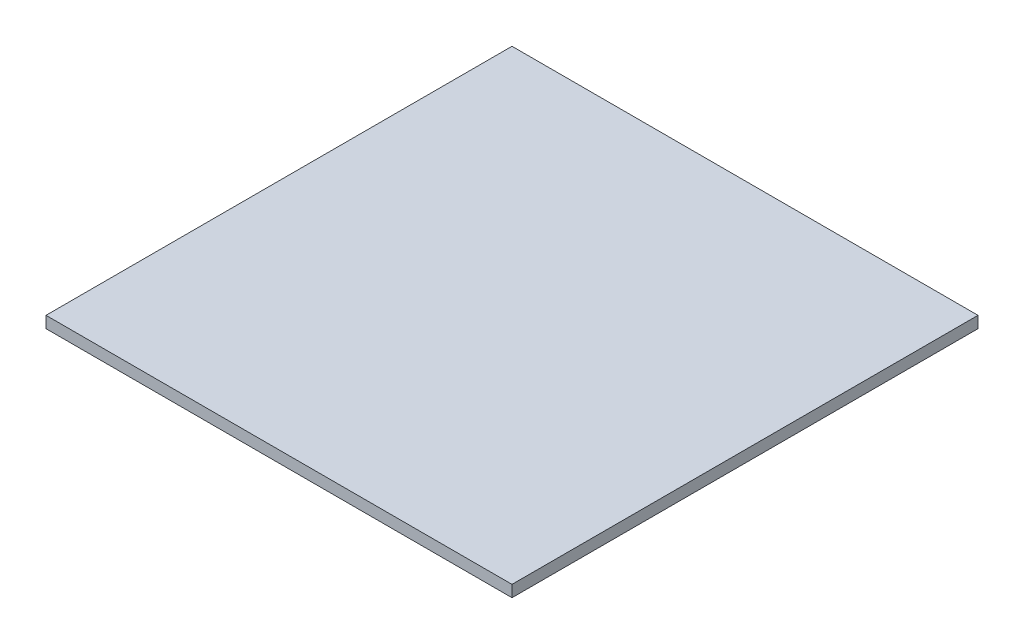
ISO-10303-21;
HEADER;
FILE_DESCRIPTION(('STEP AP214'),'2;1');
FILE_NAME('part.step','',(''),(''),'','','');
FILE_SCHEMA(('AUTOMOTIVE_DESIGN { 1 0 10303 214 1 1 1 1 }'));
ENDSEC;
DATA;
#1=APPLICATION_CONTEXT('core data for automotive mechanical design processes');
#2=APPLICATION_PROTOCOL_DEFINITION('international standard','automotive_design',2000,#1);
#3=PRODUCT_CONTEXT('',#1,'mechanical');
#4=PRODUCT('Part','Part','',(#3));
#5=PRODUCT_RELATED_PRODUCT_CATEGORY('part','',(#4));
#6=PRODUCT_DEFINITION_FORMATION('','',#4);
#7=PRODUCT_DEFINITION_CONTEXT('part definition',#1,'design');
#8=PRODUCT_DEFINITION('design','',#6,#7);
#9=PRODUCT_DEFINITION_SHAPE('','',#8);
#10=(LENGTH_UNIT() NAMED_UNIT(*) SI_UNIT(.MILLI.,.METRE.));
#11=(NAMED_UNIT(*) PLANE_ANGLE_UNIT() SI_UNIT($,.RADIAN.));
#12=(NAMED_UNIT(*) SI_UNIT($,.STERADIAN.) SOLID_ANGLE_UNIT());
#13=UNCERTAINTY_MEASURE_WITH_UNIT(LENGTH_MEASURE(1.E-05),#10,'distance_accuracy_value','');
#14=(GEOMETRIC_REPRESENTATION_CONTEXT(3) GLOBAL_UNCERTAINTY_ASSIGNED_CONTEXT((#13)) GLOBAL_UNIT_ASSIGNED_CONTEXT((#10,
#11,#12)) REPRESENTATION_CONTEXT('',''));
#15=CARTESIAN_POINT('',(0.,0.,0.));
#16=DIRECTION('',(0.,0.,1.));
#17=DIRECTION('',(1.,0.,0.));
#18=AXIS2_PLACEMENT_3D('',#15,#16,#17);
#19=CARTESIAN_POINT('',(90.5,2.25,90.5));
#20=DIRECTION('',(-1.,0.,0.));
#21=DIRECTION('',(0.,0.,1.));
#22=AXIS2_PLACEMENT_3D('',#19,#20,#21);
#23=PLANE('',#22);
#24=DIRECTION('',(0.,0.,-1.));
#25=VECTOR('',#24,1.);
#26=CARTESIAN_POINT('',(90.5,-2.25,90.5));
#27=LINE('',#26,#25);
#28=CARTESIAN_POINT('',(90.5,-2.25,90.5));
#29=VERTEX_POINT('',#28);
#30=CARTESIAN_POINT('',(90.5,-2.25,-90.5));
#31=VERTEX_POINT('',#30);
#32=EDGE_CURVE('E96',#29,#31,#27,.T.);
#33=ORIENTED_EDGE('',*,*,#32,.T.);
#34=DIRECTION('',(0.,-1.,0.));
#35=VECTOR('',#34,1.);
#36=CARTESIAN_POINT('',(90.5,2.25,-90.5));
#37=LINE('',#36,#35);
#38=CARTESIAN_POINT('',(90.5,2.25,-90.5));
#39=VERTEX_POINT('',#38);
#40=EDGE_CURVE('E11',#39,#31,#37,.T.);
#41=ORIENTED_EDGE('',*,*,#40,.F.);
#42=DIRECTION('',(0.,0.,-1.));
#43=VECTOR('',#42,1.);
#44=CARTESIAN_POINT('',(90.5,2.25,90.5));
#45=LINE('',#44,#43);
#46=CARTESIAN_POINT('',(90.5,2.25,90.5));
#47=VERTEX_POINT('',#46);
#48=EDGE_CURVE('E84',#47,#39,#45,.T.);
#49=ORIENTED_EDGE('',*,*,#48,.F.);
#50=DIRECTION('',(0.,-1.,0.));
#51=VECTOR('',#50,1.);
#52=CARTESIAN_POINT('',(90.5,2.25,90.5));
#53=LINE('',#52,#51);
#54=EDGE_CURVE('E92',#47,#29,#53,.T.);
#55=ORIENTED_EDGE('',*,*,#54,.T.);
#56=EDGE_LOOP('',(#33,#41,#49,#55));
#57=FACE_BOUND('',#56,.T.);
#58=ADVANCED_FACE('F33',(#57),#23,.F.);
#59=CARTESIAN_POINT('',(-90.5,2.25,-90.5));
#60=DIRECTION('',(0.,0.,1.));
#61=DIRECTION('',(1.,0.,0.));
#62=AXIS2_PLACEMENT_3D('',#59,#60,#61);
#63=PLANE('',#62);
#64=DIRECTION('',(-1.,0.,0.));
#65=VECTOR('',#64,1.);
#66=CARTESIAN_POINT('',(-90.5,-2.25,-90.5));
#67=LINE('',#66,#65);
#68=CARTESIAN_POINT('',(-90.5,-2.25,-90.5));
#69=VERTEX_POINT('',#68);
#70=EDGE_CURVE('E88',#31,#69,#67,.T.);
#71=ORIENTED_EDGE('',*,*,#70,.T.);
#72=DIRECTION('',(0.,-1.,0.));
#73=VECTOR('',#72,1.);
#74=CARTESIAN_POINT('',(-90.5,2.25,-90.5));
#75=LINE('',#74,#73);
#76=CARTESIAN_POINT('',(-90.5,2.25,-90.5));
#77=VERTEX_POINT('',#76);
#78=EDGE_CURVE('E41',#77,#69,#75,.T.);
#79=ORIENTED_EDGE('',*,*,#78,.F.);
#80=DIRECTION('',(-1.,0.,0.));
#81=VECTOR('',#80,1.);
#82=CARTESIAN_POINT('',(-90.5,2.25,-90.5));
#83=LINE('',#82,#81);
#84=EDGE_CURVE('E79',#39,#77,#83,.T.);
#85=ORIENTED_EDGE('',*,*,#84,.F.);
#86=ORIENTED_EDGE('',*,*,#40,.T.);
#87=EDGE_LOOP('',(#71,#79,#85,#86));
#88=FACE_BOUND('',#87,.T.);
#89=ADVANCED_FACE('F87',(#88),#63,.F.);
#90=CARTESIAN_POINT('',(-90.5,2.25,90.5));
#91=DIRECTION('',(1.,0.,0.));
#92=DIRECTION('',(0.,0.,-1.));
#93=AXIS2_PLACEMENT_3D('',#90,#91,#92);
#94=PLANE('',#93);
#95=DIRECTION('',(0.,0.,1.));
#96=VECTOR('',#95,1.);
#97=CARTESIAN_POINT('',(-90.5,-2.25,90.5));
#98=LINE('',#97,#96);
#99=CARTESIAN_POINT('',(-90.5,-2.25,90.5));
#100=VERTEX_POINT('',#99);
#101=EDGE_CURVE('E66',#69,#100,#98,.T.);
#102=ORIENTED_EDGE('',*,*,#101,.T.);
#103=DIRECTION('',(0.,-1.,0.));
#104=VECTOR('',#103,1.);
#105=CARTESIAN_POINT('',(-90.5,2.25,90.5));
#106=LINE('',#105,#104);
#107=CARTESIAN_POINT('',(-90.5,2.25,90.5));
#108=VERTEX_POINT('',#107);
#109=EDGE_CURVE('E89',#108,#100,#106,.T.);
#110=ORIENTED_EDGE('',*,*,#109,.F.);
#111=DIRECTION('',(0.,0.,1.));
#112=VECTOR('',#111,1.);
#113=CARTESIAN_POINT('',(-90.5,2.25,90.5));
#114=LINE('',#113,#112);
#115=EDGE_CURVE('E82',#77,#108,#114,.T.);
#116=ORIENTED_EDGE('',*,*,#115,.F.);
#117=ORIENTED_EDGE('',*,*,#78,.T.);
#118=EDGE_LOOP('',(#102,#110,#116,#117));
#119=FACE_BOUND('',#118,.T.);
#120=ADVANCED_FACE('F90',(#119),#94,.F.);
#121=CARTESIAN_POINT('',(-90.5,2.25,90.5));
#122=DIRECTION('',(0.,0.,-1.));
#123=DIRECTION('',(-1.,0.,0.));
#124=AXIS2_PLACEMENT_3D('',#121,#122,#123);
#125=PLANE('',#124);
#126=DIRECTION('',(1.,0.,0.));
#127=VECTOR('',#126,1.);
#128=CARTESIAN_POINT('',(-90.5,-2.25,90.5));
#129=LINE('',#128,#127);
#130=EDGE_CURVE('E72',#100,#29,#129,.T.);
#131=ORIENTED_EDGE('',*,*,#130,.T.);
#132=ORIENTED_EDGE('',*,*,#54,.F.);
#133=DIRECTION('',(1.,0.,0.));
#134=VECTOR('',#133,1.);
#135=CARTESIAN_POINT('',(-90.5,2.25,90.5));
#136=LINE('',#135,#134);
#137=EDGE_CURVE('E49',#108,#47,#136,.T.);
#138=ORIENTED_EDGE('',*,*,#137,.F.);
#139=ORIENTED_EDGE('',*,*,#109,.T.);
#140=EDGE_LOOP('',(#131,#132,#138,#139));
#141=FACE_BOUND('',#140,.T.);
#142=ADVANCED_FACE('F103',(#141),#125,.F.);
#143=CARTESIAN_POINT('',(0.,2.25,0.));
#144=DIRECTION('',(0.,-1.,0.));
#145=DIRECTION('',(0.,0.,-1.));
#146=AXIS2_PLACEMENT_3D('',#143,#144,#145);
#147=PLANE('',#146);
#148=ORIENTED_EDGE('',*,*,#48,.T.);
#149=ORIENTED_EDGE('',*,*,#84,.T.);
#150=ORIENTED_EDGE('',*,*,#115,.T.);
#151=ORIENTED_EDGE('',*,*,#137,.T.);
#152=EDGE_LOOP('',(#148,#149,#150,#151));
#153=FACE_BOUND('',#152,.T.);
#154=ADVANCED_FACE('F80',(#153),#147,.F.);
#155=CARTESIAN_POINT('',(0.,-2.25,0.));
#156=DIRECTION('',(0.,-1.,0.));
#157=DIRECTION('',(0.,0.,-1.));
#158=AXIS2_PLACEMENT_3D('',#155,#156,#157);
#159=PLANE('',#158);
#160=ORIENTED_EDGE('',*,*,#32,.F.);
#161=ORIENTED_EDGE('',*,*,#130,.F.);
#162=ORIENTED_EDGE('',*,*,#101,.F.);
#163=ORIENTED_EDGE('',*,*,#70,.F.);
#164=EDGE_LOOP('',(#160,#161,#162,#163));
#165=FACE_BOUND('',#164,.T.);
#166=ADVANCED_FACE('F106',(#165),#159,.T.);
#167=CLOSED_SHELL('',(#58,#89,#120,#142,#154,#166));
#168=MANIFOLD_SOLID_BREP('B2',#167);
#169=ADVANCED_BREP_SHAPE_REPRESENTATION('',(#18,#168),#14);
#170=SHAPE_DEFINITION_REPRESENTATION(#9,#169);
ENDSEC;
END-ISO-10303-21;
